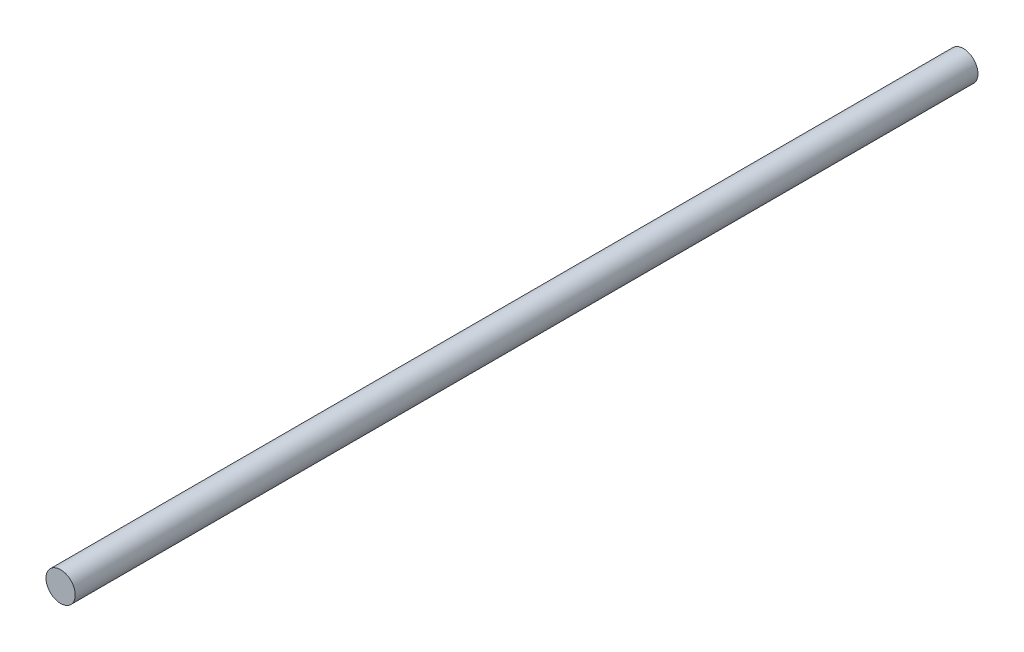
ISO-10303-21;
HEADER;
FILE_DESCRIPTION(('STEP AP214'),'2;1');
FILE_NAME('part.step','',(''),(''),'','','');
FILE_SCHEMA(('AUTOMOTIVE_DESIGN { 1 0 10303 214 1 1 1 1 }'));
ENDSEC;
DATA;
#1=APPLICATION_CONTEXT('core data for automotive mechanical design processes');
#2=APPLICATION_PROTOCOL_DEFINITION('international standard','automotive_design',2000,#1);
#3=PRODUCT_CONTEXT('',#1,'mechanical');
#4=PRODUCT('Part','Part','',(#3));
#5=PRODUCT_RELATED_PRODUCT_CATEGORY('part','',(#4));
#6=PRODUCT_DEFINITION_FORMATION('','',#4);
#7=PRODUCT_DEFINITION_CONTEXT('part definition',#1,'design');
#8=PRODUCT_DEFINITION('design','',#6,#7);
#9=PRODUCT_DEFINITION_SHAPE('','',#8);
#10=(LENGTH_UNIT() NAMED_UNIT(*) SI_UNIT(.MILLI.,.METRE.));
#11=(NAMED_UNIT(*) PLANE_ANGLE_UNIT() SI_UNIT($,.RADIAN.));
#12=(NAMED_UNIT(*) SI_UNIT($,.STERADIAN.) SOLID_ANGLE_UNIT());
#13=UNCERTAINTY_MEASURE_WITH_UNIT(LENGTH_MEASURE(1.E-05),#10,'distance_accuracy_value','');
#14=(GEOMETRIC_REPRESENTATION_CONTEXT(3) GLOBAL_UNCERTAINTY_ASSIGNED_CONTEXT((#13)) GLOBAL_UNIT_ASSIGNED_CONTEXT((#10,
#11,#12)) REPRESENTATION_CONTEXT('',''));
#15=CARTESIAN_POINT('',(0.,0.,0.));
#16=DIRECTION('',(0.,0.,1.));
#17=DIRECTION('',(1.,0.,0.));
#18=AXIS2_PLACEMENT_3D('',#15,#16,#17);
#19=CARTESIAN_POINT('',(0.,0.,185.));
#20=DIRECTION('',(0.,0.,-1.));
#21=DIRECTION('',(-1.,0.,0.));
#22=AXIS2_PLACEMENT_3D('',#19,#20,#21);
#23=CYLINDRICAL_SURFACE('',#22,3.);
#24=CARTESIAN_POINT('',(0.,0.,185.));
#25=DIRECTION('',(0.,0.,1.));
#26=DIRECTION('',(1.,0.,0.));
#27=AXIS2_PLACEMENT_3D('',#24,#25,#26);
#28=CIRCLE('',#27,3.);
#29=CARTESIAN_POINT('',(3.,0.,185.));
#30=VERTEX_POINT('',#29);
#31=EDGE_CURVE('E10',#30,#30,#28,.T.);
#32=ORIENTED_EDGE('',*,*,#31,.F.);
#33=EDGE_LOOP('',(#32));
#34=FACE_BOUND('',#33,.T.);
#35=CARTESIAN_POINT('',(0.,0.,0.));
#36=DIRECTION('',(0.,0.,1.));
#37=DIRECTION('',(1.,0.,0.));
#38=AXIS2_PLACEMENT_3D('',#35,#36,#37);
#39=CIRCLE('',#38,3.);
#40=CARTESIAN_POINT('',(3.,0.,0.));
#41=VERTEX_POINT('',#40);
#42=EDGE_CURVE('E32',#41,#41,#39,.T.);
#43=ORIENTED_EDGE('',*,*,#42,.T.);
#44=EDGE_LOOP('',(#43));
#45=FACE_BOUND('',#44,.T.);
#46=ADVANCED_FACE('F29',(#34,#45),#23,.T.);
#47=CARTESIAN_POINT('',(0.,0.,185.));
#48=DIRECTION('',(0.,0.,1.));
#49=DIRECTION('',(1.,0.,0.));
#50=AXIS2_PLACEMENT_3D('',#47,#48,#49);
#51=PLANE('',#50);
#52=ORIENTED_EDGE('',*,*,#31,.T.);
#53=EDGE_LOOP('',(#52));
#54=FACE_BOUND('',#53,.T.);
#55=ADVANCED_FACE('F44',(#54),#51,.T.);
#56=CARTESIAN_POINT('',(0.,0.,0.));
#57=DIRECTION('',(0.,0.,1.));
#58=DIRECTION('',(1.,0.,0.));
#59=AXIS2_PLACEMENT_3D('',#56,#57,#58);
#60=PLANE('',#59);
#61=ORIENTED_EDGE('',*,*,#42,.F.);
#62=EDGE_LOOP('',(#61));
#63=FACE_BOUND('',#62,.T.);
#64=ADVANCED_FACE('F42',(#63),#60,.F.);
#65=CLOSED_SHELL('',(#46,#55,#64));
#66=MANIFOLD_SOLID_BREP('B2',#65);
#67=ADVANCED_BREP_SHAPE_REPRESENTATION('',(#18,#66),#14);
#68=SHAPE_DEFINITION_REPRESENTATION(#9,#67);
ENDSEC;
END-ISO-10303-21;
